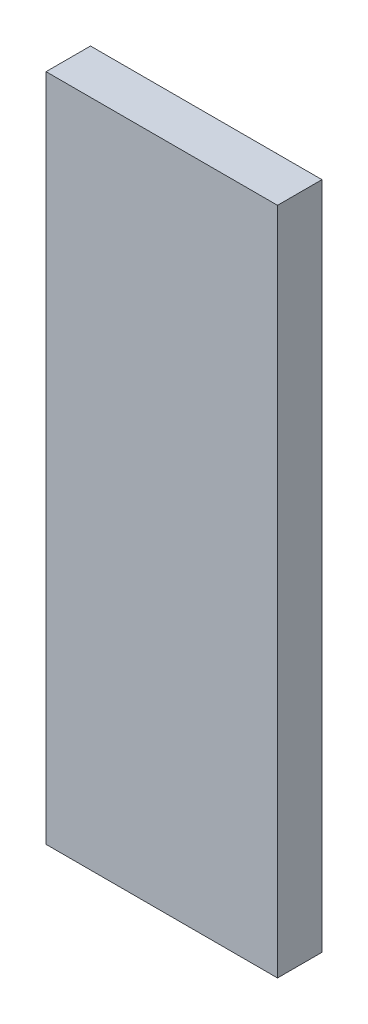
ISO-10303-21;
HEADER;
FILE_DESCRIPTION(('STEP AP214'),'2;1');
FILE_NAME('part.step','',(''),(''),'','','');
FILE_SCHEMA(('AUTOMOTIVE_DESIGN { 1 0 10303 214 1 1 1 1 }'));
ENDSEC;
DATA;
#1=APPLICATION_CONTEXT('core data for automotive mechanical design processes');
#2=APPLICATION_PROTOCOL_DEFINITION('international standard','automotive_design',2000,#1);
#3=PRODUCT_CONTEXT('',#1,'mechanical');
#4=PRODUCT('Part','Part','',(#3));
#5=PRODUCT_RELATED_PRODUCT_CATEGORY('part','',(#4));
#6=PRODUCT_DEFINITION_FORMATION('','',#4);
#7=PRODUCT_DEFINITION_CONTEXT('part definition',#1,'design');
#8=PRODUCT_DEFINITION('design','',#6,#7);
#9=PRODUCT_DEFINITION_SHAPE('','',#8);
#10=(LENGTH_UNIT() NAMED_UNIT(*) SI_UNIT(.MILLI.,.METRE.));
#11=(NAMED_UNIT(*) PLANE_ANGLE_UNIT() SI_UNIT($,.RADIAN.));
#12=(NAMED_UNIT(*) SI_UNIT($,.STERADIAN.) SOLID_ANGLE_UNIT());
#13=UNCERTAINTY_MEASURE_WITH_UNIT(LENGTH_MEASURE(1.E-05),#10,'distance_accuracy_value','');
#14=(GEOMETRIC_REPRESENTATION_CONTEXT(3) GLOBAL_UNCERTAINTY_ASSIGNED_CONTEXT((#13)) GLOBAL_UNIT_ASSIGNED_CONTEXT((#10,
#11,#12)) REPRESENTATION_CONTEXT('',''));
#15=CARTESIAN_POINT('',(0.,0.,0.));
#16=DIRECTION('',(0.,0.,1.));
#17=DIRECTION('',(1.,0.,0.));
#18=AXIS2_PLACEMENT_3D('',#15,#16,#17);
#19=CARTESIAN_POINT('',(0.62500002,1.80691028,0.23999952));
#20=DIRECTION('',(0.,0.,1.));
#21=DIRECTION('',(1.,0.,0.));
#22=AXIS2_PLACEMENT_3D('',#19,#20,#21);
#23=PLANE('',#22);
#24=DIRECTION('',(1.,0.,0.));
#25=VECTOR('',#24,1.);
#26=CARTESIAN_POINT('',(-0.62500002,1.80691028,0.23999952));
#27=LINE('',#26,#25);
#28=CARTESIAN_POINT('',(-0.62500002,1.80691028,0.23999952));
#29=VERTEX_POINT('',#28);
#30=CARTESIAN_POINT('',(0.62500002,1.80691028,0.23999952));
#31=VERTEX_POINT('',#30);
#32=EDGE_CURVE('E26',#29,#31,#27,.T.);
#33=ORIENTED_EDGE('',*,*,#32,.F.);
#34=DIRECTION('',(0.,1.,0.));
#35=VECTOR('',#34,1.);
#36=CARTESIAN_POINT('',(-0.62500002,-1.80690774,0.23999952));
#37=LINE('',#36,#35);
#38=CARTESIAN_POINT('',(-0.62500002,-1.80690774,0.23999952));
#39=VERTEX_POINT('',#38);
#40=EDGE_CURVE('E60',#39,#29,#37,.T.);
#41=ORIENTED_EDGE('',*,*,#40,.F.);
#42=DIRECTION('',(-1.,0.,0.));
#43=VECTOR('',#42,1.);
#44=CARTESIAN_POINT('',(0.62500002,-1.80690774,0.23999952));
#45=LINE('',#44,#43);
#46=CARTESIAN_POINT('',(0.62500002,-1.80690774,0.23999952));
#47=VERTEX_POINT('',#46);
#48=EDGE_CURVE('E92',#47,#39,#45,.T.);
#49=ORIENTED_EDGE('',*,*,#48,.F.);
#50=DIRECTION('',(0.,-1.,0.));
#51=VECTOR('',#50,1.);
#52=CARTESIAN_POINT('',(0.62500002,1.80691028,0.23999952));
#53=LINE('',#52,#51);
#54=EDGE_CURVE('E95',#31,#47,#53,.T.);
#55=ORIENTED_EDGE('',*,*,#54,.F.);
#56=EDGE_LOOP('',(#33,#41,#49,#55));
#57=FACE_BOUND('',#56,.T.);
#58=ADVANCED_FACE('F16',(#57),#23,.T.);
#59=CARTESIAN_POINT('',(0.62500002,1.80691028,0.));
#60=DIRECTION('',(0.,0.,1.));
#61=DIRECTION('',(1.,0.,0.));
#62=AXIS2_PLACEMENT_3D('',#59,#60,#61);
#63=PLANE('',#62);
#64=DIRECTION('',(0.,-1.,0.));
#65=VECTOR('',#64,1.);
#66=CARTESIAN_POINT('',(0.62500002,1.80691028,0.));
#67=LINE('',#66,#65);
#68=CARTESIAN_POINT('',(0.62500002,1.80691028,0.));
#69=VERTEX_POINT('',#68);
#70=CARTESIAN_POINT('',(0.62500002,-1.80690774,0.));
#71=VERTEX_POINT('',#70);
#72=EDGE_CURVE('E81',#69,#71,#67,.T.);
#73=ORIENTED_EDGE('',*,*,#72,.T.);
#74=DIRECTION('',(-1.,0.,0.));
#75=VECTOR('',#74,1.);
#76=CARTESIAN_POINT('',(0.62500002,-1.80690774,0.));
#77=LINE('',#76,#75);
#78=CARTESIAN_POINT('',(-0.62500002,-1.80690774,0.));
#79=VERTEX_POINT('',#78);
#80=EDGE_CURVE('E20',#71,#79,#77,.T.);
#81=ORIENTED_EDGE('',*,*,#80,.T.);
#82=DIRECTION('',(0.,1.,0.));
#83=VECTOR('',#82,1.);
#84=CARTESIAN_POINT('',(-0.62500002,-1.80690774,0.));
#85=LINE('',#84,#83);
#86=CARTESIAN_POINT('',(-0.62500002,1.80691028,0.));
#87=VERTEX_POINT('',#86);
#88=EDGE_CURVE('E83',#79,#87,#85,.T.);
#89=ORIENTED_EDGE('',*,*,#88,.T.);
#90=DIRECTION('',(1.,0.,0.));
#91=VECTOR('',#90,1.);
#92=CARTESIAN_POINT('',(-0.62500002,1.80691028,0.));
#93=LINE('',#92,#91);
#94=EDGE_CURVE('E10',#87,#69,#93,.T.);
#95=ORIENTED_EDGE('',*,*,#94,.T.);
#96=EDGE_LOOP('',(#73,#81,#89,#95));
#97=FACE_BOUND('',#96,.T.);
#98=ADVANCED_FACE('F80',(#97),#63,.F.);
#99=CARTESIAN_POINT('',(-0.62500002,1.80691028,0.));
#100=DIRECTION('',(0.,1.,0.));
#101=DIRECTION('',(1.,0.,0.));
#102=AXIS2_PLACEMENT_3D('',#99,#100,#101);
#103=PLANE('',#102);
#104=DIRECTION('',(0.,0.,1.));
#105=VECTOR('',#104,1.);
#106=CARTESIAN_POINT('',(-0.62500002,1.80691028,0.));
#107=LINE('',#106,#105);
#108=EDGE_CURVE('E106',#87,#29,#107,.T.);
#109=ORIENTED_EDGE('',*,*,#108,.T.);
#110=ORIENTED_EDGE('',*,*,#32,.T.);
#111=DIRECTION('',(0.,0.,1.));
#112=VECTOR('',#111,1.);
#113=CARTESIAN_POINT('',(0.62500002,1.80691028,0.));
#114=LINE('',#113,#112);
#115=EDGE_CURVE('E89',#69,#31,#114,.T.);
#116=ORIENTED_EDGE('',*,*,#115,.F.);
#117=ORIENTED_EDGE('',*,*,#94,.F.);
#118=EDGE_LOOP('',(#109,#110,#116,#117));
#119=FACE_BOUND('',#118,.T.);
#120=ADVANCED_FACE('F18',(#119),#103,.T.);
#121=CARTESIAN_POINT('',(-0.62500002,-1.80690774,0.));
#122=DIRECTION('',(-1.,0.,0.));
#123=DIRECTION('',(0.,0.,1.));
#124=AXIS2_PLACEMENT_3D('',#121,#122,#123);
#125=PLANE('',#124);
#126=DIRECTION('',(0.,0.,1.));
#127=VECTOR('',#126,1.);
#128=CARTESIAN_POINT('',(-0.62500002,-1.80690774,0.));
#129=LINE('',#128,#127);
#130=EDGE_CURVE('E107',#79,#39,#129,.T.);
#131=ORIENTED_EDGE('',*,*,#130,.T.);
#132=ORIENTED_EDGE('',*,*,#40,.T.);
#133=ORIENTED_EDGE('',*,*,#108,.F.);
#134=ORIENTED_EDGE('',*,*,#88,.F.);
#135=EDGE_LOOP('',(#131,#132,#133,#134));
#136=FACE_BOUND('',#135,.T.);
#137=ADVANCED_FACE('F127',(#136),#125,.T.);
#138=CARTESIAN_POINT('',(0.62500002,-1.80690774,0.));
#139=DIRECTION('',(0.,-1.,0.));
#140=DIRECTION('',(0.,0.,-1.));
#141=AXIS2_PLACEMENT_3D('',#138,#139,#140);
#142=PLANE('',#141);
#143=DIRECTION('',(0.,0.,1.));
#144=VECTOR('',#143,1.);
#145=CARTESIAN_POINT('',(0.62500002,-1.80690774,0.));
#146=LINE('',#145,#144);
#147=EDGE_CURVE('E90',#71,#47,#146,.T.);
#148=ORIENTED_EDGE('',*,*,#147,.T.);
#149=ORIENTED_EDGE('',*,*,#48,.T.);
#150=ORIENTED_EDGE('',*,*,#130,.F.);
#151=ORIENTED_EDGE('',*,*,#80,.F.);
#152=EDGE_LOOP('',(#148,#149,#150,#151));
#153=FACE_BOUND('',#152,.T.);
#154=ADVANCED_FACE('F117',(#153),#142,.T.);
#155=CARTESIAN_POINT('',(0.62500002,1.80691028,0.));
#156=DIRECTION('',(1.,0.,0.));
#157=DIRECTION('',(0.,1.,0.));
#158=AXIS2_PLACEMENT_3D('',#155,#156,#157);
#159=PLANE('',#158);
#160=ORIENTED_EDGE('',*,*,#115,.T.);
#161=ORIENTED_EDGE('',*,*,#54,.T.);
#162=ORIENTED_EDGE('',*,*,#147,.F.);
#163=ORIENTED_EDGE('',*,*,#72,.F.);
#164=EDGE_LOOP('',(#160,#161,#162,#163));
#165=FACE_BOUND('',#164,.T.);
#166=ADVANCED_FACE('F87',(#165),#159,.T.);
#167=CLOSED_SHELL('',(#58,#98,#120,#137,#154,#166));
#168=MANIFOLD_SOLID_BREP('B1',#167);
#169=ADVANCED_BREP_SHAPE_REPRESENTATION('',(#18,#168),#14);
#170=SHAPE_DEFINITION_REPRESENTATION(#9,#169);
ENDSEC;
END-ISO-10303-21;
